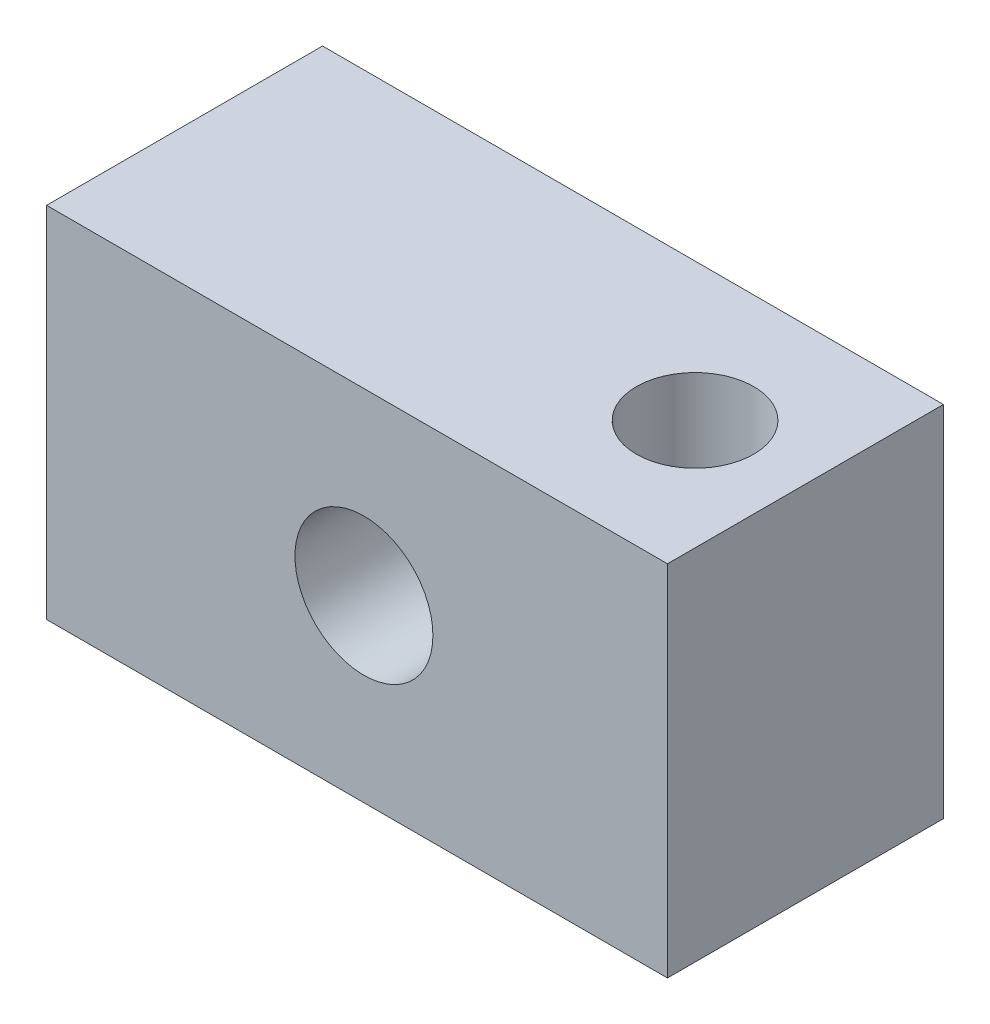
ISO-10303-21;
HEADER;
FILE_DESCRIPTION(('STEP AP214'),'2;1');
FILE_NAME('part.step','',(''),(''),'','','');
FILE_SCHEMA(('AUTOMOTIVE_DESIGN { 1 0 10303 214 1 1 1 1 }'));
ENDSEC;
DATA;
#1=APPLICATION_CONTEXT('core data for automotive mechanical design processes');
#2=APPLICATION_PROTOCOL_DEFINITION('international standard','automotive_design',2000,#1);
#3=PRODUCT_CONTEXT('',#1,'mechanical');
#4=PRODUCT('Part','Part','',(#3));
#5=PRODUCT_RELATED_PRODUCT_CATEGORY('part','',(#4));
#6=PRODUCT_DEFINITION_FORMATION('','',#4);
#7=PRODUCT_DEFINITION_CONTEXT('part definition',#1,'design');
#8=PRODUCT_DEFINITION('design','',#6,#7);
#9=PRODUCT_DEFINITION_SHAPE('','',#8);
#10=(LENGTH_UNIT() NAMED_UNIT(*) SI_UNIT(.MILLI.,.METRE.));
#11=(NAMED_UNIT(*) PLANE_ANGLE_UNIT() SI_UNIT($,.RADIAN.));
#12=(NAMED_UNIT(*) SI_UNIT($,.STERADIAN.) SOLID_ANGLE_UNIT());
#13=UNCERTAINTY_MEASURE_WITH_UNIT(LENGTH_MEASURE(1.E-05),#10,'distance_accuracy_value','');
#14=(GEOMETRIC_REPRESENTATION_CONTEXT(3) GLOBAL_UNCERTAINTY_ASSIGNED_CONTEXT((#13)) GLOBAL_UNIT_ASSIGNED_CONTEXT((#10,
#11,#12)) REPRESENTATION_CONTEXT('',''));
#15=CARTESIAN_POINT('',(0.,0.,0.));
#16=DIRECTION('',(0.,0.,1.));
#17=DIRECTION('',(1.,0.,0.));
#18=AXIS2_PLACEMENT_3D('',#15,#16,#17);
#19=CARTESIAN_POINT('',(-45.,26.,20.));
#20=DIRECTION('',(1.,0.,0.));
#21=DIRECTION('',(0.,1.,0.));
#22=AXIS2_PLACEMENT_3D('',#19,#20,#21);
#23=PLANE('',#22);
#24=DIRECTION('',(0.,-1.,0.));
#25=VECTOR('',#24,1.);
#26=CARTESIAN_POINT('',(-45.,26.,0.));
#27=LINE('',#26,#25);
#28=CARTESIAN_POINT('',(-45.,26.,0.));
#29=VERTEX_POINT('',#28);
#30=CARTESIAN_POINT('',(-45.,0.,0.));
#31=VERTEX_POINT('',#30);
#32=EDGE_CURVE('E101',#29,#31,#27,.T.);
#33=ORIENTED_EDGE('',*,*,#32,.T.);
#34=DIRECTION('',(0.,0.,-1.));
#35=VECTOR('',#34,1.);
#36=CARTESIAN_POINT('',(-45.,0.,20.));
#37=LINE('',#36,#35);
#38=CARTESIAN_POINT('',(-45.,0.,20.));
#39=VERTEX_POINT('',#38);
#40=EDGE_CURVE('E11',#39,#31,#37,.T.);
#41=ORIENTED_EDGE('',*,*,#40,.F.);
#42=DIRECTION('',(0.,-1.,0.));
#43=VECTOR('',#42,1.);
#44=CARTESIAN_POINT('',(-45.,26.,20.));
#45=LINE('',#44,#43);
#46=CARTESIAN_POINT('',(-45.,26.,20.));
#47=VERTEX_POINT('',#46);
#48=EDGE_CURVE('E88',#47,#39,#45,.T.);
#49=ORIENTED_EDGE('',*,*,#48,.F.);
#50=DIRECTION('',(0.,0.,-1.));
#51=VECTOR('',#50,1.);
#52=CARTESIAN_POINT('',(-45.,26.,20.));
#53=LINE('',#52,#51);
#54=EDGE_CURVE('E97',#47,#29,#53,.T.);
#55=ORIENTED_EDGE('',*,*,#54,.T.);
#56=EDGE_LOOP('',(#33,#41,#49,#55));
#57=FACE_BOUND('',#56,.T.);
#58=ADVANCED_FACE('F36',(#57),#23,.F.);
#59=CARTESIAN_POINT('',(-45.,0.,20.));
#60=DIRECTION('',(0.,1.,0.));
#61=DIRECTION('',(0.,0.,1.));
#62=AXIS2_PLACEMENT_3D('',#59,#60,#61);
#63=PLANE('',#62);
#64=CARTESIAN_POINT('',(-8.,0.,10.));
#65=DIRECTION('',(0.,1.,0.));
#66=DIRECTION('',(0.,0.,1.));
#67=AXIS2_PLACEMENT_3D('',#64,#65,#66);
#68=CIRCLE('',#67,4.24999999999999);
#69=CARTESIAN_POINT('',(-8.,0.,14.25));
#70=VERTEX_POINT('',#69);
#71=EDGE_CURVE('E117',#70,#70,#68,.T.);
#72=ORIENTED_EDGE('',*,*,#71,.T.);
#73=EDGE_LOOP('',(#72));
#74=FACE_BOUND('',#73,.T.);
#75=DIRECTION('',(1.,0.,0.));
#76=VECTOR('',#75,1.);
#77=CARTESIAN_POINT('',(-45.,0.,0.));
#78=LINE('',#77,#76);
#79=CARTESIAN_POINT('',(0.,0.,0.));
#80=VERTEX_POINT('',#79);
#81=EDGE_CURVE('E92',#31,#80,#78,.T.);
#82=ORIENTED_EDGE('',*,*,#81,.T.);
#83=DIRECTION('',(0.,0.,-1.));
#84=VECTOR('',#83,1.);
#85=CARTESIAN_POINT('',(0.,0.,20.));
#86=LINE('',#85,#84);
#87=CARTESIAN_POINT('',(0.,0.,20.));
#88=VERTEX_POINT('',#87);
#89=EDGE_CURVE('E45',#88,#80,#86,.T.);
#90=ORIENTED_EDGE('',*,*,#89,.F.);
#91=DIRECTION('',(1.,0.,0.));
#92=VECTOR('',#91,1.);
#93=CARTESIAN_POINT('',(-45.,0.,20.));
#94=LINE('',#93,#92);
#95=EDGE_CURVE('E83',#39,#88,#94,.T.);
#96=ORIENTED_EDGE('',*,*,#95,.F.);
#97=ORIENTED_EDGE('',*,*,#40,.T.);
#98=EDGE_LOOP('',(#82,#90,#96,#97));
#99=FACE_BOUND('',#98,.T.);
#100=ADVANCED_FACE('F91',(#74,#99),#63,.F.);
#101=CARTESIAN_POINT('',(0.,26.,20.));
#102=DIRECTION('',(-1.,0.,0.));
#103=DIRECTION('',(0.,-1.,0.));
#104=AXIS2_PLACEMENT_3D('',#101,#102,#103);
#105=PLANE('',#104);
#106=DIRECTION('',(0.,1.,0.));
#107=VECTOR('',#106,1.);
#108=CARTESIAN_POINT('',(0.,26.,0.));
#109=LINE('',#108,#107);
#110=CARTESIAN_POINT('',(0.,26.,0.));
#111=VERTEX_POINT('',#110);
#112=EDGE_CURVE('E70',#80,#111,#109,.T.);
#113=ORIENTED_EDGE('',*,*,#112,.T.);
#114=DIRECTION('',(0.,0.,-1.));
#115=VECTOR('',#114,1.);
#116=CARTESIAN_POINT('',(0.,26.,20.));
#117=LINE('',#116,#115);
#118=CARTESIAN_POINT('',(0.,26.,20.));
#119=VERTEX_POINT('',#118);
#120=EDGE_CURVE('E93',#119,#111,#117,.T.);
#121=ORIENTED_EDGE('',*,*,#120,.F.);
#122=DIRECTION('',(0.,1.,0.));
#123=VECTOR('',#122,1.);
#124=CARTESIAN_POINT('',(0.,26.,20.));
#125=LINE('',#124,#123);
#126=EDGE_CURVE('E86',#88,#119,#125,.T.);
#127=ORIENTED_EDGE('',*,*,#126,.F.);
#128=ORIENTED_EDGE('',*,*,#89,.T.);
#129=EDGE_LOOP('',(#113,#121,#127,#128));
#130=FACE_BOUND('',#129,.T.);
#131=ADVANCED_FACE('F95',(#130),#105,.F.);
#132=CARTESIAN_POINT('',(-45.,26.,20.));
#133=DIRECTION('',(0.,-1.,0.));
#134=DIRECTION('',(1.,0.,0.));
#135=AXIS2_PLACEMENT_3D('',#132,#133,#134);
#136=PLANE('',#135);
#137=CARTESIAN_POINT('',(-8.,26.,10.));
#138=DIRECTION('',(0.,1.,0.));
#139=DIRECTION('',(0.,0.,1.));
#140=AXIS2_PLACEMENT_3D('',#137,#138,#139);
#141=CIRCLE('',#140,4.24999999999999);
#142=CARTESIAN_POINT('',(-8.,26.,14.25));
#143=VERTEX_POINT('',#142);
#144=EDGE_CURVE('E120',#143,#143,#141,.T.);
#145=ORIENTED_EDGE('',*,*,#144,.F.);
#146=EDGE_LOOP('',(#145));
#147=FACE_BOUND('',#146,.T.);
#148=DIRECTION('',(-1.,0.,0.));
#149=VECTOR('',#148,1.);
#150=CARTESIAN_POINT('',(-45.,26.,0.));
#151=LINE('',#150,#149);
#152=EDGE_CURVE('E76',#111,#29,#151,.T.);
#153=ORIENTED_EDGE('',*,*,#152,.T.);
#154=ORIENTED_EDGE('',*,*,#54,.F.);
#155=DIRECTION('',(-1.,0.,0.));
#156=VECTOR('',#155,1.);
#157=CARTESIAN_POINT('',(-45.,26.,20.));
#158=LINE('',#157,#156);
#159=EDGE_CURVE('E53',#119,#47,#158,.T.);
#160=ORIENTED_EDGE('',*,*,#159,.F.);
#161=ORIENTED_EDGE('',*,*,#120,.T.);
#162=EDGE_LOOP('',(#153,#154,#160,#161));
#163=FACE_BOUND('',#162,.T.);
#164=ADVANCED_FACE('F108',(#147,#163),#136,.F.);
#165=CARTESIAN_POINT('',(0.,0.,20.));
#166=DIRECTION('',(0.,0.,1.));
#167=DIRECTION('',(1.,0.,0.));
#168=AXIS2_PLACEMENT_3D('',#165,#166,#167);
#169=PLANE('',#168);
#170=CARTESIAN_POINT('',(-22.,13.,20.));
#171=DIRECTION('',(0.,0.,1.));
#172=DIRECTION('',(1.,0.,0.));
#173=AXIS2_PLACEMENT_3D('',#170,#171,#172);
#174=CIRCLE('',#173,5.);
#175=CARTESIAN_POINT('',(-17.,13.,20.));
#176=VERTEX_POINT('',#175);
#177=EDGE_CURVE('E114',#176,#176,#174,.F.);
#178=ORIENTED_EDGE('',*,*,#177,.T.);
#179=EDGE_LOOP('',(#178));
#180=FACE_BOUND('',#179,.T.);
#181=ORIENTED_EDGE('',*,*,#48,.T.);
#182=ORIENTED_EDGE('',*,*,#95,.T.);
#183=ORIENTED_EDGE('',*,*,#126,.T.);
#184=ORIENTED_EDGE('',*,*,#159,.T.);
#185=EDGE_LOOP('',(#181,#182,#183,#184));
#186=FACE_BOUND('',#185,.T.);
#187=ADVANCED_FACE('F84',(#180,#186),#169,.T.);
#188=CARTESIAN_POINT('',(0.,0.,0.));
#189=DIRECTION('',(0.,0.,1.));
#190=DIRECTION('',(1.,0.,0.));
#191=AXIS2_PLACEMENT_3D('',#188,#189,#190);
#192=PLANE('',#191);
#193=CARTESIAN_POINT('',(-22.,13.,0.));
#194=DIRECTION('',(0.,0.,1.));
#195=DIRECTION('',(1.,0.,0.));
#196=AXIS2_PLACEMENT_3D('',#193,#194,#195);
#197=CIRCLE('',#196,5.);
#198=CARTESIAN_POINT('',(-17.,13.,0.));
#199=VERTEX_POINT('',#198);
#200=EDGE_CURVE('E39',#199,#199,#197,.F.);
#201=ORIENTED_EDGE('',*,*,#200,.F.);
#202=EDGE_LOOP('',(#201));
#203=FACE_BOUND('',#202,.T.);
#204=ORIENTED_EDGE('',*,*,#32,.F.);
#205=ORIENTED_EDGE('',*,*,#152,.F.);
#206=ORIENTED_EDGE('',*,*,#112,.F.);
#207=ORIENTED_EDGE('',*,*,#81,.F.);
#208=EDGE_LOOP('',(#204,#205,#206,#207));
#209=FACE_BOUND('',#208,.T.);
#210=ADVANCED_FACE('F111',(#203,#209),#192,.F.);
#211=CARTESIAN_POINT('',(-22.,13.,-1.2E-05));
#212=DIRECTION('',(0.,0.,1.));
#213=DIRECTION('',(1.,0.,0.));
#214=AXIS2_PLACEMENT_3D('',#211,#212,#213);
#215=CYLINDRICAL_SURFACE('',#214,5.);
#216=ORIENTED_EDGE('',*,*,#177,.F.);
#217=EDGE_LOOP('',(#216));
#218=FACE_BOUND('',#217,.T.);
#219=ORIENTED_EDGE('',*,*,#200,.T.);
#220=EDGE_LOOP('',(#219));
#221=FACE_BOUND('',#220,.T.);
#222=ADVANCED_FACE('F146',(#218,#221),#215,.F.);
#223=CARTESIAN_POINT('',(-8.,26.,10.));
#224=DIRECTION('',(0.,1.,0.));
#225=DIRECTION('',(0.,0.,1.));
#226=AXIS2_PLACEMENT_3D('',#223,#224,#225);
#227=CYLINDRICAL_SURFACE('',#226,4.24999999999999);
#228=ORIENTED_EDGE('',*,*,#71,.F.);
#229=EDGE_LOOP('',(#228));
#230=FACE_BOUND('',#229,.T.);
#231=ORIENTED_EDGE('',*,*,#144,.T.);
#232=EDGE_LOOP('',(#231));
#233=FACE_BOUND('',#232,.T.);
#234=ADVANCED_FACE('F124',(#230,#233),#227,.F.);
#235=CLOSED_SHELL('',(#58,#100,#131,#164,#187,#210,#222,#234));
#236=MANIFOLD_SOLID_BREP('B2',#235);
#237=ADVANCED_BREP_SHAPE_REPRESENTATION('',(#18,#236),#14);
#238=SHAPE_DEFINITION_REPRESENTATION(#9,#237);
ENDSEC;
END-ISO-10303-21;
